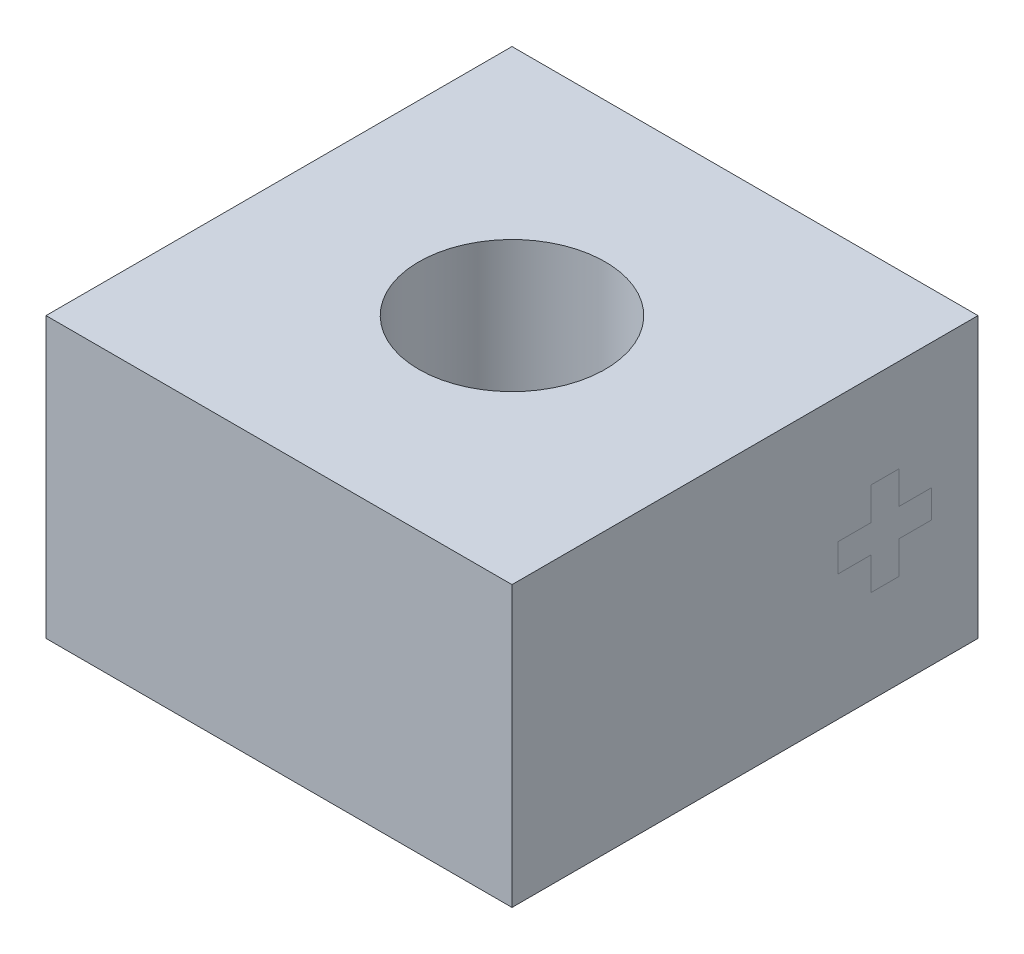
ISO-10303-21;
HEADER;
FILE_DESCRIPTION(('STEP AP214'),'2;1');
FILE_NAME('part.step','',(''),(''),'','','');
FILE_SCHEMA(('AUTOMOTIVE_DESIGN { 1 0 10303 214 1 1 1 1 }'));
ENDSEC;
DATA;
#1=APPLICATION_CONTEXT('core data for automotive mechanical design processes');
#2=APPLICATION_PROTOCOL_DEFINITION('international standard','automotive_design',2000,#1);
#3=PRODUCT_CONTEXT('',#1,'mechanical');
#4=PRODUCT('Part','Part','',(#3));
#5=PRODUCT_RELATED_PRODUCT_CATEGORY('part','',(#4));
#6=PRODUCT_DEFINITION_FORMATION('','',#4);
#7=PRODUCT_DEFINITION_CONTEXT('part definition',#1,'design');
#8=PRODUCT_DEFINITION('design','',#6,#7);
#9=PRODUCT_DEFINITION_SHAPE('','',#8);
#10=(LENGTH_UNIT() NAMED_UNIT(*) SI_UNIT(.MILLI.,.METRE.));
#11=(NAMED_UNIT(*) PLANE_ANGLE_UNIT() SI_UNIT($,.RADIAN.));
#12=(NAMED_UNIT(*) SI_UNIT($,.STERADIAN.) SOLID_ANGLE_UNIT());
#13=UNCERTAINTY_MEASURE_WITH_UNIT(LENGTH_MEASURE(1.E-05),#10,'distance_accuracy_value','');
#14=(GEOMETRIC_REPRESENTATION_CONTEXT(3) GLOBAL_UNCERTAINTY_ASSIGNED_CONTEXT((#13)) GLOBAL_UNIT_ASSIGNED_CONTEXT((#10,
#11,#12)) REPRESENTATION_CONTEXT('',''));
#15=CARTESIAN_POINT('',(0.,0.,0.));
#16=DIRECTION('',(0.,0.,1.));
#17=DIRECTION('',(1.,0.,0.));
#18=AXIS2_PLACEMENT_3D('',#15,#16,#17);
#19=CARTESIAN_POINT('',(2.5,3.,-2.5));
#20=DIRECTION('',(-1.,0.,0.));
#21=DIRECTION('',(0.,0.,1.));
#22=AXIS2_PLACEMENT_3D('',#19,#20,#21);
#23=PLANE('',#22);
#24=DIRECTION('',(0.,0.,-1.));
#25=VECTOR('',#24,1.);
#26=CARTESIAN_POINT('',(2.5,1.,-1.35));
#27=LINE('',#26,#25);
#28=CARTESIAN_POINT('',(2.5,1.,-1.35));
#29=VERTEX_POINT('',#28);
#30=CARTESIAN_POINT('',(2.5,1.,-1.65));
#31=VERTEX_POINT('',#30);
#32=EDGE_CURVE('E378',#29,#31,#27,.T.);
#33=ORIENTED_EDGE('',*,*,#32,.T.);
#34=DIRECTION('',(0.,1.,0.));
#35=VECTOR('',#34,1.);
#36=CARTESIAN_POINT('',(2.5,1.35,-1.65));
#37=LINE('',#36,#35);
#38=CARTESIAN_POINT('',(2.5,1.35,-1.65));
#39=VERTEX_POINT('',#38);
#40=EDGE_CURVE('E15',#31,#39,#37,.T.);
#41=ORIENTED_EDGE('',*,*,#40,.T.);
#42=DIRECTION('',(0.,0.,-1.));
#43=VECTOR('',#42,1.);
#44=CARTESIAN_POINT('',(2.5,1.35,-1.65));
#45=LINE('',#44,#43);
#46=CARTESIAN_POINT('',(2.5,1.35,-2.));
#47=VERTEX_POINT('',#46);
#48=EDGE_CURVE('E469',#39,#47,#45,.T.);
#49=ORIENTED_EDGE('',*,*,#48,.T.);
#50=DIRECTION('',(0.,1.,0.));
#51=VECTOR('',#50,1.);
#52=CARTESIAN_POINT('',(2.5,1.65,-2.));
#53=LINE('',#52,#51);
#54=CARTESIAN_POINT('',(2.5,1.65,-2.));
#55=VERTEX_POINT('',#54);
#56=EDGE_CURVE('E475',#47,#55,#53,.T.);
#57=ORIENTED_EDGE('',*,*,#56,.T.);
#58=DIRECTION('',(0.,0.,1.));
#59=VECTOR('',#58,1.);
#60=CARTESIAN_POINT('',(2.5,1.65,-1.65));
#61=LINE('',#60,#59);
#62=CARTESIAN_POINT('',(2.5,1.65,-1.65));
#63=VERTEX_POINT('',#62);
#64=EDGE_CURVE('E485',#55,#63,#61,.T.);
#65=ORIENTED_EDGE('',*,*,#64,.T.);
#66=DIRECTION('',(0.,1.,0.));
#67=VECTOR('',#66,1.);
#68=CARTESIAN_POINT('',(2.5,2.,-1.65));
#69=LINE('',#68,#67);
#70=CARTESIAN_POINT('',(2.5,2.,-1.65));
#71=VERTEX_POINT('',#70);
#72=EDGE_CURVE('E489',#63,#71,#69,.T.);
#73=ORIENTED_EDGE('',*,*,#72,.T.);
#74=DIRECTION('',(0.,0.,1.));
#75=VECTOR('',#74,1.);
#76=CARTESIAN_POINT('',(2.5,2.,-1.35));
#77=LINE('',#76,#75);
#78=CARTESIAN_POINT('',(2.5,2.,-1.35));
#79=VERTEX_POINT('',#78);
#80=EDGE_CURVE('E493',#71,#79,#77,.T.);
#81=ORIENTED_EDGE('',*,*,#80,.T.);
#82=DIRECTION('',(0.,-1.,0.));
#83=VECTOR('',#82,1.);
#84=CARTESIAN_POINT('',(2.5,2.,-1.35));
#85=LINE('',#84,#83);
#86=CARTESIAN_POINT('',(2.5,1.65,-1.35));
#87=VERTEX_POINT('',#86);
#88=EDGE_CURVE('E497',#79,#87,#85,.T.);
#89=ORIENTED_EDGE('',*,*,#88,.T.);
#90=DIRECTION('',(0.,0.,1.));
#91=VECTOR('',#90,1.);
#92=CARTESIAN_POINT('',(2.5,1.65,-1.));
#93=LINE('',#92,#91);
#94=CARTESIAN_POINT('',(2.5,1.65,-1.));
#95=VERTEX_POINT('',#94);
#96=EDGE_CURVE('E500',#87,#95,#93,.T.);
#97=ORIENTED_EDGE('',*,*,#96,.T.);
#98=DIRECTION('',(0.,-1.,0.));
#99=VECTOR('',#98,1.);
#100=CARTESIAN_POINT('',(2.5,1.65,-1.));
#101=LINE('',#100,#99);
#102=CARTESIAN_POINT('',(2.5,1.35,-1.));
#103=VERTEX_POINT('',#102);
#104=EDGE_CURVE('E504',#95,#103,#101,.T.);
#105=ORIENTED_EDGE('',*,*,#104,.T.);
#106=DIRECTION('',(0.,0.,-1.));
#107=VECTOR('',#106,1.);
#108=CARTESIAN_POINT('',(2.5,1.35,-1.));
#109=LINE('',#108,#107);
#110=CARTESIAN_POINT('',(2.5,1.35,-1.35));
#111=VERTEX_POINT('',#110);
#112=EDGE_CURVE('E508',#103,#111,#109,.T.);
#113=ORIENTED_EDGE('',*,*,#112,.T.);
#114=DIRECTION('',(0.,-1.,0.));
#115=VECTOR('',#114,1.);
#116=CARTESIAN_POINT('',(2.5,1.35,-1.35));
#117=LINE('',#116,#115);
#118=EDGE_CURVE('E512',#111,#29,#117,.T.);
#119=ORIENTED_EDGE('',*,*,#118,.T.);
#120=EDGE_LOOP('',(#33,#41,#49,#57,#65,#73,#81,#89,#97,#105,#113,#119));
#121=FACE_BOUND('',#120,.T.);
#122=ADVANCED_FACE('F368',(#121),#23,.F.);
#123=CARTESIAN_POINT('',(-2.5,3.,-2.5));
#124=DIRECTION('',(1.,0.,0.));
#125=DIRECTION('',(0.,0.,-1.));
#126=AXIS2_PLACEMENT_3D('',#123,#124,#125);
#127=PLANE('',#126);
#128=DIRECTION('',(0.,0.,1.));
#129=VECTOR('',#128,1.);
#130=CARTESIAN_POINT('',(-2.5,0.,-2.5));
#131=LINE('',#130,#129);
#132=CARTESIAN_POINT('',(-2.5,0.,-2.5));
#133=VERTEX_POINT('',#132);
#134=CARTESIAN_POINT('',(-2.5,0.,2.5));
#135=VERTEX_POINT('',#134);
#136=EDGE_CURVE('E467',#133,#135,#131,.T.);
#137=ORIENTED_EDGE('',*,*,#136,.T.);
#138=DIRECTION('',(0.,-1.,0.));
#139=VECTOR('',#138,1.);
#140=CARTESIAN_POINT('',(-2.5,3.,2.5));
#141=LINE('',#140,#139);
#142=CARTESIAN_POINT('',(-2.5,3.,2.5));
#143=VERTEX_POINT('',#142);
#144=EDGE_CURVE('E446',#143,#135,#141,.T.);
#145=ORIENTED_EDGE('',*,*,#144,.F.);
#146=DIRECTION('',(0.,0.,1.));
#147=VECTOR('',#146,1.);
#148=CARTESIAN_POINT('',(-2.5,3.,-2.5));
#149=LINE('',#148,#147);
#150=CARTESIAN_POINT('',(-2.5,3.,-2.5));
#151=VERTEX_POINT('',#150);
#152=EDGE_CURVE('E454',#151,#143,#149,.T.);
#153=ORIENTED_EDGE('',*,*,#152,.F.);
#154=DIRECTION('',(0.,-1.,0.));
#155=VECTOR('',#154,1.);
#156=CARTESIAN_POINT('',(-2.5,3.,-2.5));
#157=LINE('',#156,#155);
#158=EDGE_CURVE('E534',#151,#133,#157,.T.);
#159=ORIENTED_EDGE('',*,*,#158,.T.);
#160=EDGE_LOOP('',(#137,#145,#153,#159));
#161=FACE_BOUND('',#160,.T.);
#162=ADVANCED_FACE('F370',(#161),#127,.F.);
#163=CARTESIAN_POINT('',(-2.5,3.,2.5));
#164=DIRECTION('',(0.,0.,-1.));
#165=DIRECTION('',(-1.,0.,0.));
#166=AXIS2_PLACEMENT_3D('',#163,#164,#165);
#167=PLANE('',#166);
#168=DIRECTION('',(1.,0.,0.));
#169=VECTOR('',#168,1.);
#170=CARTESIAN_POINT('',(-2.5,0.,2.5));
#171=LINE('',#170,#169);
#172=CARTESIAN_POINT('',(2.5,0.,2.5));
#173=VERTEX_POINT('',#172);
#174=EDGE_CURVE('E530',#135,#173,#171,.T.);
#175=ORIENTED_EDGE('',*,*,#174,.T.);
#176=DIRECTION('',(0.,-1.,0.));
#177=VECTOR('',#176,1.);
#178=CARTESIAN_POINT('',(2.5,3.,2.5));
#179=LINE('',#178,#177);
#180=CARTESIAN_POINT('',(2.5,3.,2.5));
#181=VERTEX_POINT('',#180);
#182=EDGE_CURVE('E449',#181,#173,#179,.T.);
#183=ORIENTED_EDGE('',*,*,#182,.F.);
#184=DIRECTION('',(1.,0.,0.));
#185=VECTOR('',#184,1.);
#186=CARTESIAN_POINT('',(-2.5,3.,2.5));
#187=LINE('',#186,#185);
#188=EDGE_CURVE('E442',#143,#181,#187,.T.);
#189=ORIENTED_EDGE('',*,*,#188,.F.);
#190=ORIENTED_EDGE('',*,*,#144,.T.);
#191=EDGE_LOOP('',(#175,#183,#189,#190));
#192=FACE_BOUND('',#191,.T.);
#193=ADVANCED_FACE('F444',(#192),#167,.F.);
#194=ORIENTED_EDGE('',*,*,#40,.F.);
#195=ORIENTED_EDGE('',*,*,#32,.F.);
#196=ORIENTED_EDGE('',*,*,#118,.F.);
#197=ORIENTED_EDGE('',*,*,#112,.F.);
#198=ORIENTED_EDGE('',*,*,#104,.F.);
#199=ORIENTED_EDGE('',*,*,#96,.F.);
#200=ORIENTED_EDGE('',*,*,#88,.F.);
#201=ORIENTED_EDGE('',*,*,#80,.F.);
#202=ORIENTED_EDGE('',*,*,#72,.F.);
#203=ORIENTED_EDGE('',*,*,#64,.F.);
#204=ORIENTED_EDGE('',*,*,#56,.F.);
#205=ORIENTED_EDGE('',*,*,#48,.F.);
#206=EDGE_LOOP('',(#194,#195,#196,#197,#198,#199,#200,#201,#202,#203,#204,#205));
#207=FACE_BOUND('',#206,.T.);
#208=DIRECTION('',(0.,0.,-1.));
#209=VECTOR('',#208,1.);
#210=CARTESIAN_POINT('',(2.5,0.,-2.5));
#211=LINE('',#210,#209);
#212=CARTESIAN_POINT('',(2.5,0.,-2.5));
#213=VERTEX_POINT('',#212);
#214=EDGE_CURVE('E525',#173,#213,#211,.T.);
#215=ORIENTED_EDGE('',*,*,#214,.T.);
#216=DIRECTION('',(0.,-1.,0.));
#217=VECTOR('',#216,1.);
#218=CARTESIAN_POINT('',(2.5,3.,-2.5));
#219=LINE('',#218,#217);
#220=CARTESIAN_POINT('',(2.5,3.,-2.5));
#221=VERTEX_POINT('',#220);
#222=EDGE_CURVE('E478',#221,#213,#219,.T.);
#223=ORIENTED_EDGE('',*,*,#222,.F.);
#224=DIRECTION('',(0.,0.,-1.));
#225=VECTOR('',#224,1.);
#226=CARTESIAN_POINT('',(2.5,3.,-2.5));
#227=LINE('',#226,#225);
#228=EDGE_CURVE('E453',#181,#221,#227,.T.);
#229=ORIENTED_EDGE('',*,*,#228,.F.);
#230=ORIENTED_EDGE('',*,*,#182,.T.);
#231=EDGE_LOOP('',(#215,#223,#229,#230));
#232=FACE_BOUND('',#231,.T.);
#233=ADVANCED_FACE('F518',(#207,#232),#23,.F.);
#234=CARTESIAN_POINT('',(-2.5,3.,-2.5));
#235=DIRECTION('',(0.,0.,1.));
#236=DIRECTION('',(1.,0.,0.));
#237=AXIS2_PLACEMENT_3D('',#234,#235,#236);
#238=PLANE('',#237);
#239=DIRECTION('',(-1.,0.,0.));
#240=VECTOR('',#239,1.);
#241=CARTESIAN_POINT('',(-2.5,0.,-2.5));
#242=LINE('',#241,#240);
#243=EDGE_CURVE('E464',#213,#133,#242,.T.);
#244=ORIENTED_EDGE('',*,*,#243,.T.);
#245=ORIENTED_EDGE('',*,*,#158,.F.);
#246=DIRECTION('',(-1.,0.,0.));
#247=VECTOR('',#246,1.);
#248=CARTESIAN_POINT('',(-2.5,3.,-2.5));
#249=LINE('',#248,#247);
#250=EDGE_CURVE('E459',#221,#151,#249,.T.);
#251=ORIENTED_EDGE('',*,*,#250,.F.);
#252=ORIENTED_EDGE('',*,*,#222,.T.);
#253=EDGE_LOOP('',(#244,#245,#251,#252));
#254=FACE_BOUND('',#253,.T.);
#255=ADVANCED_FACE('F521',(#254),#238,.F.);
#256=CARTESIAN_POINT('',(0.,3.,0.));
#257=DIRECTION('',(0.,1.,0.));
#258=DIRECTION('',(0.,0.,1.));
#259=AXIS2_PLACEMENT_3D('',#256,#257,#258);
#260=PLANE('',#259);
#261=CARTESIAN_POINT('',(0.,3.,0.));
#262=DIRECTION('',(0.,1.,0.));
#263=DIRECTION('',(0.,0.,1.));
#264=AXIS2_PLACEMENT_3D('',#261,#262,#263);
#265=CIRCLE('',#264,1.);
#266=CARTESIAN_POINT('',(0.,3.,1.));
#267=VERTEX_POINT('',#266);
#268=EDGE_CURVE('E547',#267,#267,#265,.T.);
#269=ORIENTED_EDGE('',*,*,#268,.F.);
#270=EDGE_LOOP('',(#269));
#271=FACE_BOUND('',#270,.T.);
#272=ORIENTED_EDGE('',*,*,#152,.T.);
#273=ORIENTED_EDGE('',*,*,#188,.T.);
#274=ORIENTED_EDGE('',*,*,#228,.T.);
#275=ORIENTED_EDGE('',*,*,#250,.T.);
#276=EDGE_LOOP('',(#272,#273,#274,#275));
#277=FACE_BOUND('',#276,.T.);
#278=ADVANCED_FACE('F457',(#271,#277),#260,.T.);
#279=CARTESIAN_POINT('',(0.,0.,0.));
#280=DIRECTION('',(0.,1.,0.));
#281=DIRECTION('',(0.,0.,1.));
#282=AXIS2_PLACEMENT_3D('',#279,#280,#281);
#283=PLANE('',#282);
#284=CARTESIAN_POINT('',(0.,0.,0.));
#285=DIRECTION('',(0.,1.,0.));
#286=DIRECTION('',(0.,0.,1.));
#287=AXIS2_PLACEMENT_3D('',#284,#285,#286);
#288=CIRCLE('',#287,1.);
#289=CARTESIAN_POINT('',(0.,0.,1.));
#290=VERTEX_POINT('',#289);
#291=EDGE_CURVE('E372',#290,#290,#288,.T.);
#292=ORIENTED_EDGE('',*,*,#291,.T.);
#293=EDGE_LOOP('',(#292));
#294=FACE_BOUND('',#293,.T.);
#295=ORIENTED_EDGE('',*,*,#136,.F.);
#296=ORIENTED_EDGE('',*,*,#243,.F.);
#297=ORIENTED_EDGE('',*,*,#214,.F.);
#298=ORIENTED_EDGE('',*,*,#174,.F.);
#299=EDGE_LOOP('',(#295,#296,#297,#298));
#300=FACE_BOUND('',#299,.T.);
#301=ADVANCED_FACE('F535',(#294,#300),#283,.F.);
#302=CARTESIAN_POINT('',(0.,-1.999,0.));
#303=DIRECTION('',(0.,1.,0.));
#304=DIRECTION('',(0.,0.,1.));
#305=AXIS2_PLACEMENT_3D('',#302,#303,#304);
#306=CYLINDRICAL_SURFACE('',#305,1.);
#307=ORIENTED_EDGE('',*,*,#268,.T.);
#308=EDGE_LOOP('',(#307));
#309=FACE_BOUND('',#308,.T.);
#310=ORIENTED_EDGE('',*,*,#291,.F.);
#311=EDGE_LOOP('',(#310));
#312=FACE_BOUND('',#311,.T.);
#313=ADVANCED_FACE('F591',(#309,#312),#306,.F.);
#314=CLOSED_SHELL('',(#122,#162,#193,#233,#255,#278,#301,#313));
#315=MANIFOLD_SOLID_BREP('B2',#314);
#316=ADVANCED_BREP_SHAPE_REPRESENTATION('',(#18,#315),#14);
#317=SHAPE_DEFINITION_REPRESENTATION(#9,#316);
ENDSEC;
END-ISO-10303-21;
